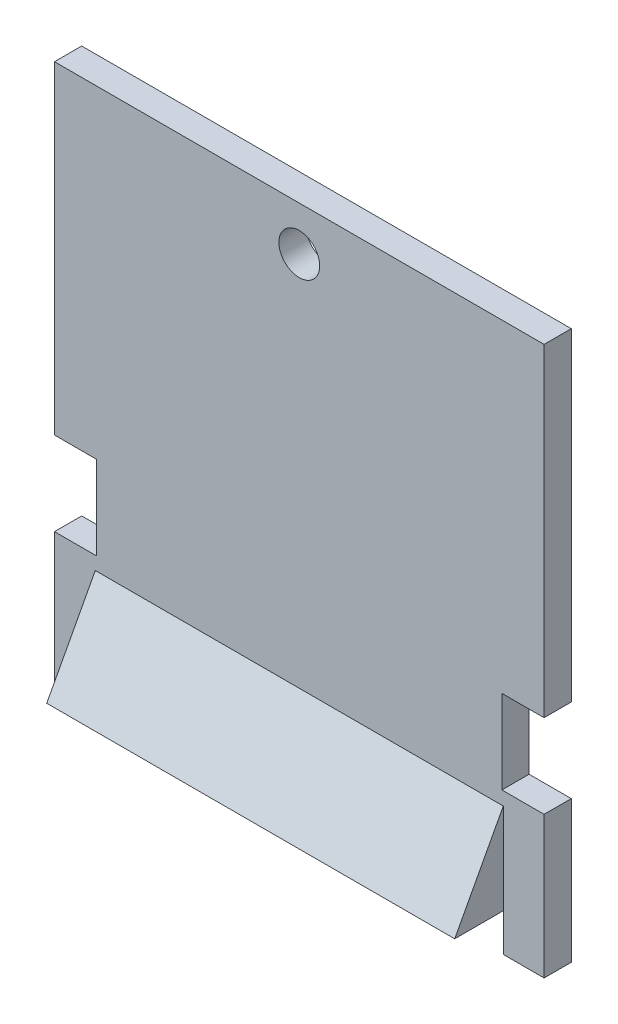
ISO-10303-21;
HEADER;
FILE_DESCRIPTION(('STEP AP214'),'2;1');
FILE_NAME('part.step','',(''),(''),'','','');
FILE_SCHEMA(('AUTOMOTIVE_DESIGN { 1 0 10303 214 1 1 1 1 }'));
ENDSEC;
DATA;
#1=APPLICATION_CONTEXT('core data for automotive mechanical design processes');
#2=APPLICATION_PROTOCOL_DEFINITION('international standard','automotive_design',2000,#1);
#3=PRODUCT_CONTEXT('',#1,'mechanical');
#4=PRODUCT('Part','Part','',(#3));
#5=PRODUCT_RELATED_PRODUCT_CATEGORY('part','',(#4));
#6=PRODUCT_DEFINITION_FORMATION('','',#4);
#7=PRODUCT_DEFINITION_CONTEXT('part definition',#1,'design');
#8=PRODUCT_DEFINITION('design','',#6,#7);
#9=PRODUCT_DEFINITION_SHAPE('','',#8);
#10=(LENGTH_UNIT() NAMED_UNIT(*) SI_UNIT(.MILLI.,.METRE.));
#11=(NAMED_UNIT(*) PLANE_ANGLE_UNIT() SI_UNIT($,.RADIAN.));
#12=(NAMED_UNIT(*) SI_UNIT($,.STERADIAN.) SOLID_ANGLE_UNIT());
#13=UNCERTAINTY_MEASURE_WITH_UNIT(LENGTH_MEASURE(1.E-05),#10,'distance_accuracy_value','');
#14=(GEOMETRIC_REPRESENTATION_CONTEXT(3) GLOBAL_UNCERTAINTY_ASSIGNED_CONTEXT((#13)) GLOBAL_UNIT_ASSIGNED_CONTEXT((#10,
#11,#12)) REPRESENTATION_CONTEXT('',''));
#15=CARTESIAN_POINT('',(0.,0.,0.));
#16=DIRECTION('',(0.,0.,1.));
#17=DIRECTION('',(1.,0.,0.));
#18=AXIS2_PLACEMENT_3D('',#15,#16,#17);
#19=CARTESIAN_POINT('',(-18.,0.,0.));
#20=DIRECTION('',(1.,0.,0.));
#21=DIRECTION('',(0.,0.,-1.));
#22=AXIS2_PLACEMENT_3D('',#19,#20,#21);
#23=PLANE('',#22);
#24=DIRECTION('',(0.,-1.,0.));
#25=VECTOR('',#24,1.);
#26=CARTESIAN_POINT('',(-18.,2.78,2.));
#27=LINE('',#26,#25);
#28=CARTESIAN_POINT('',(-18.,10.425,2.));
#29=VERTEX_POINT('',#28);
#30=CARTESIAN_POINT('',(-18.,0.,2.));
#31=VERTEX_POINT('',#30);
#32=EDGE_CURVE('E279',#29,#31,#27,.T.);
#33=ORIENTED_EDGE('',*,*,#32,.F.);
#34=DIRECTION('',(0.,0.,-1.));
#35=VECTOR('',#34,1.);
#36=CARTESIAN_POINT('',(-18.,10.425,0.));
#37=LINE('',#36,#35);
#38=CARTESIAN_POINT('',(-18.,10.425,0.));
#39=VERTEX_POINT('',#38);
#40=EDGE_CURVE('E216',#29,#39,#37,.T.);
#41=ORIENTED_EDGE('',*,*,#40,.T.);
#42=DIRECTION('',(0.,1.,0.));
#43=VECTOR('',#42,1.);
#44=CARTESIAN_POINT('',(-18.,0.,0.));
#45=LINE('',#44,#43);
#46=CARTESIAN_POINT('',(-18.,0.,0.));
#47=VERTEX_POINT('',#46);
#48=EDGE_CURVE('E292',#47,#39,#45,.T.);
#49=ORIENTED_EDGE('',*,*,#48,.F.);
#50=DIRECTION('',(0.,0.,-1.));
#51=VECTOR('',#50,1.);
#52=CARTESIAN_POINT('',(-18.,0.,2.));
#53=LINE('',#52,#51);
#54=EDGE_CURVE('E213',#31,#47,#53,.T.);
#55=ORIENTED_EDGE('',*,*,#54,.F.);
#56=EDGE_LOOP('',(#33,#41,#49,#55));
#57=FACE_BOUND('',#56,.T.);
#58=ADVANCED_FACE('F34',(#57),#23,.F.);
#59=CARTESIAN_POINT('',(18.,9.45,2.));
#60=DIRECTION('',(0.,-0.471891250848428,-0.881656762789639));
#61=DIRECTION('',(0.,0.881656762789639,-0.471891250848428));
#62=AXIS2_PLACEMENT_3D('',#59,#60,#61);
#63=PLANE('',#62);
#64=DIRECTION('',(0.,0.881656762789639,-0.471891250848428));
#65=VECTOR('',#64,1.);
#66=CARTESIAN_POINT('',(-15.,9.45000000000002,1.99999999999999));
#67=LINE('',#66,#65);
#68=CARTESIAN_POINT('',(-15.,2.78,5.57));
#69=VERTEX_POINT('',#68);
#70=CARTESIAN_POINT('',(-15.,9.45,1.99999999999999));
#71=VERTEX_POINT('',#70);
#72=EDGE_CURVE('E162',#69,#71,#67,.T.);
#73=ORIENTED_EDGE('',*,*,#72,.F.);
#74=DIRECTION('',(-1.,0.,0.));
#75=VECTOR('',#74,1.);
#76=CARTESIAN_POINT('',(18.,2.78,5.57));
#77=LINE('',#76,#75);
#78=CARTESIAN_POINT('',(15.,2.78,5.57));
#79=VERTEX_POINT('',#78);
#80=EDGE_CURVE('E175',#79,#69,#77,.T.);
#81=ORIENTED_EDGE('',*,*,#80,.F.);
#82=DIRECTION('',(0.,-0.881656762789639,0.471891250848428));
#83=VECTOR('',#82,1.);
#84=CARTESIAN_POINT('',(15.,9.45,2.));
#85=LINE('',#84,#83);
#86=CARTESIAN_POINT('',(15.,9.45,1.99999999999999));
#87=VERTEX_POINT('',#86);
#88=EDGE_CURVE('E168',#87,#79,#85,.T.);
#89=ORIENTED_EDGE('',*,*,#88,.F.);
#90=DIRECTION('',(-1.,0.,0.));
#91=VECTOR('',#90,1.);
#92=CARTESIAN_POINT('',(18.,9.45,2.));
#93=LINE('',#92,#91);
#94=EDGE_CURVE('E177',#87,#71,#93,.T.);
#95=ORIENTED_EDGE('',*,*,#94,.T.);
#96=EDGE_LOOP('',(#73,#81,#89,#95));
#97=FACE_BOUND('',#96,.T.);
#98=ADVANCED_FACE('F173',(#97),#63,.F.);
#99=CARTESIAN_POINT('',(18.,2.78,5.57));
#100=DIRECTION('',(0.,1.,0.));
#101=DIRECTION('',(0.,0.,1.));
#102=AXIS2_PLACEMENT_3D('',#99,#100,#101);
#103=PLANE('',#102);
#104=DIRECTION('',(0.,0.,-1.));
#105=VECTOR('',#104,1.);
#106=CARTESIAN_POINT('',(-15.,2.78,5.57));
#107=LINE('',#106,#105);
#108=CARTESIAN_POINT('',(-15.,2.78,1.99999999999999));
#109=VERTEX_POINT('',#108);
#110=EDGE_CURVE('E159',#69,#109,#107,.T.);
#111=ORIENTED_EDGE('',*,*,#110,.T.);
#112=DIRECTION('',(0.,0.,-1.));
#113=VECTOR('',#112,1.);
#114=CARTESIAN_POINT('',(-15.,2.78,5.57));
#115=LINE('',#114,#113);
#116=CARTESIAN_POINT('',(-15.,2.78,0.));
#117=VERTEX_POINT('',#116);
#118=EDGE_CURVE('E267',#109,#117,#115,.T.);
#119=ORIENTED_EDGE('',*,*,#118,.T.);
#120=DIRECTION('',(1.,0.,0.));
#121=VECTOR('',#120,1.);
#122=CARTESIAN_POINT('',(15.,2.78,0.));
#123=LINE('',#122,#121);
#124=CARTESIAN_POINT('',(15.,2.78,0.));
#125=VERTEX_POINT('',#124);
#126=EDGE_CURVE('E262',#117,#125,#123,.T.);
#127=ORIENTED_EDGE('',*,*,#126,.T.);
#128=DIRECTION('',(0.,0.,-1.));
#129=VECTOR('',#128,1.);
#130=CARTESIAN_POINT('',(15.,2.78,5.57));
#131=LINE('',#130,#129);
#132=CARTESIAN_POINT('',(15.,2.78,1.99999999999999));
#133=VERTEX_POINT('',#132);
#134=EDGE_CURVE('E214',#133,#125,#131,.T.);
#135=ORIENTED_EDGE('',*,*,#134,.F.);
#136=DIRECTION('',(0.,0.,-1.));
#137=VECTOR('',#136,1.);
#138=CARTESIAN_POINT('',(15.,2.78,5.57));
#139=LINE('',#138,#137);
#140=EDGE_CURVE('E184',#79,#133,#139,.T.);
#141=ORIENTED_EDGE('',*,*,#140,.F.);
#142=ORIENTED_EDGE('',*,*,#80,.T.);
#143=EDGE_LOOP('',(#111,#119,#127,#135,#141,#142));
#144=FACE_BOUND('',#143,.T.);
#145=ADVANCED_FACE('F181',(#144),#103,.F.);
#146=CARTESIAN_POINT('',(18.,0.,0.));
#147=DIRECTION('',(1.,0.,0.));
#148=DIRECTION('',(0.,0.,-1.));
#149=AXIS2_PLACEMENT_3D('',#146,#147,#148);
#150=PLANE('',#149);
#151=DIRECTION('',(0.,0.,1.));
#152=VECTOR('',#151,1.);
#153=CARTESIAN_POINT('',(18.,16.575,0.));
#154=LINE('',#153,#152);
#155=CARTESIAN_POINT('',(18.,16.575,0.));
#156=VERTEX_POINT('',#155);
#157=CARTESIAN_POINT('',(18.,16.575,2.));
#158=VERTEX_POINT('',#157);
#159=EDGE_CURVE('E221',#156,#158,#154,.T.);
#160=ORIENTED_EDGE('',*,*,#159,.F.);
#161=DIRECTION('',(0.,1.,0.));
#162=VECTOR('',#161,1.);
#163=CARTESIAN_POINT('',(18.,0.,0.));
#164=LINE('',#163,#162);
#165=CARTESIAN_POINT('',(18.,40.35,0.));
#166=VERTEX_POINT('',#165);
#167=EDGE_CURVE('E278',#156,#166,#164,.T.);
#168=ORIENTED_EDGE('',*,*,#167,.T.);
#169=DIRECTION('',(0.,0.,1.));
#170=VECTOR('',#169,1.);
#171=CARTESIAN_POINT('',(18.,40.35,0.));
#172=LINE('',#171,#170);
#173=CARTESIAN_POINT('',(18.,40.35,2.));
#174=VERTEX_POINT('',#173);
#175=EDGE_CURVE('E283',#166,#174,#172,.T.);
#176=ORIENTED_EDGE('',*,*,#175,.T.);
#177=DIRECTION('',(0.,-1.,0.));
#178=VECTOR('',#177,1.);
#179=CARTESIAN_POINT('',(18.,40.35,2.));
#180=LINE('',#179,#178);
#181=EDGE_CURVE('E285',#174,#158,#180,.T.);
#182=ORIENTED_EDGE('',*,*,#181,.T.);
#183=EDGE_LOOP('',(#160,#168,#176,#182));
#184=FACE_BOUND('',#183,.T.);
#185=ADVANCED_FACE('F363',(#184),#150,.T.);
#186=CARTESIAN_POINT('',(18.,0.,2.));
#187=DIRECTION('',(0.,1.,0.));
#188=DIRECTION('',(0.,0.,1.));
#189=AXIS2_PLACEMENT_3D('',#186,#187,#188);
#190=PLANE('',#189);
#191=DIRECTION('',(-1.,0.,0.));
#192=VECTOR('',#191,1.);
#193=CARTESIAN_POINT('',(18.,0.,2.));
#194=LINE('',#193,#192);
#195=CARTESIAN_POINT('',(18.,0.,2.));
#196=VERTEX_POINT('',#195);
#197=CARTESIAN_POINT('',(15.,0.,2.));
#198=VERTEX_POINT('',#197);
#199=EDGE_CURVE('E185',#196,#198,#194,.T.);
#200=ORIENTED_EDGE('',*,*,#199,.T.);
#201=DIRECTION('',(0.,0.,-1.));
#202=VECTOR('',#201,1.);
#203=CARTESIAN_POINT('',(15.,0.,5.57));
#204=LINE('',#203,#202);
#205=CARTESIAN_POINT('',(15.,0.,0.));
#206=VERTEX_POINT('',#205);
#207=EDGE_CURVE('E265',#198,#206,#204,.T.);
#208=ORIENTED_EDGE('',*,*,#207,.T.);
#209=DIRECTION('',(-1.,0.,0.));
#210=VECTOR('',#209,1.);
#211=CARTESIAN_POINT('',(18.,0.,0.));
#212=LINE('',#211,#210);
#213=CARTESIAN_POINT('',(18.,0.,0.));
#214=VERTEX_POINT('',#213);
#215=EDGE_CURVE('E200',#214,#206,#212,.T.);
#216=ORIENTED_EDGE('',*,*,#215,.F.);
#217=DIRECTION('',(0.,0.,-1.));
#218=VECTOR('',#217,1.);
#219=CARTESIAN_POINT('',(18.,0.,2.));
#220=LINE('',#219,#218);
#221=EDGE_CURVE('E275',#196,#214,#220,.T.);
#222=ORIENTED_EDGE('',*,*,#221,.F.);
#223=EDGE_LOOP('',(#200,#208,#216,#222));
#224=FACE_BOUND('',#223,.T.);
#225=ADVANCED_FACE('F390',(#224),#190,.F.);
#226=CARTESIAN_POINT('',(-15.,0.,0.));
#227=VERTEX_POINT('',#226);
#228=EDGE_CURVE('E199',#227,#47,#212,.T.);
#229=ORIENTED_EDGE('',*,*,#228,.F.);
#230=DIRECTION('',(0.,0.,-1.));
#231=VECTOR('',#230,1.);
#232=CARTESIAN_POINT('',(-15.,0.,5.57));
#233=LINE('',#232,#231);
#234=CARTESIAN_POINT('',(-15.,0.,2.));
#235=VERTEX_POINT('',#234);
#236=EDGE_CURVE('E269',#235,#227,#233,.T.);
#237=ORIENTED_EDGE('',*,*,#236,.F.);
#238=EDGE_CURVE('E190',#235,#31,#194,.T.);
#239=ORIENTED_EDGE('',*,*,#238,.T.);
#240=ORIENTED_EDGE('',*,*,#54,.T.);
#241=EDGE_LOOP('',(#229,#237,#239,#240));
#242=FACE_BOUND('',#241,.T.);
#243=ADVANCED_FACE('F36',(#242),#190,.F.);
#244=CARTESIAN_POINT('',(18.,0.,0.));
#245=DIRECTION('',(0.,0.,1.));
#246=DIRECTION('',(0.,-1.,0.));
#247=AXIS2_PLACEMENT_3D('',#244,#245,#246);
#248=PLANE('',#247);
#249=CARTESIAN_POINT('',(0.,37.1,0.));
#250=DIRECTION('',(0.,0.,-1.));
#251=DIRECTION('',(-1.,0.,0.));
#252=AXIS2_PLACEMENT_3D('',#249,#250,#251);
#253=CIRCLE('',#252,1.5);
#254=CARTESIAN_POINT('',(-1.5,37.1,0.));
#255=VERTEX_POINT('',#254);
#256=EDGE_CURVE('E256',#255,#255,#253,.T.);
#257=ORIENTED_EDGE('',*,*,#256,.F.);
#258=EDGE_LOOP('',(#257));
#259=FACE_BOUND('',#258,.T.);
#260=ORIENTED_EDGE('',*,*,#167,.F.);
#261=DIRECTION('',(1.,0.,0.));
#262=VECTOR('',#261,1.);
#263=CARTESIAN_POINT('',(18.,16.575,0.));
#264=LINE('',#263,#262);
#265=CARTESIAN_POINT('',(14.9,16.575,0.));
#266=VERTEX_POINT('',#265);
#267=EDGE_CURVE('E323',#266,#156,#264,.T.);
#268=ORIENTED_EDGE('',*,*,#267,.F.);
#269=DIRECTION('',(0.,1.,0.));
#270=VECTOR('',#269,1.);
#271=CARTESIAN_POINT('',(14.9,16.575,0.));
#272=LINE('',#271,#270);
#273=CARTESIAN_POINT('',(14.9,10.425,0.));
#274=VERTEX_POINT('',#273);
#275=EDGE_CURVE('E320',#274,#266,#272,.T.);
#276=ORIENTED_EDGE('',*,*,#275,.F.);
#277=DIRECTION('',(-1.,0.,0.));
#278=VECTOR('',#277,1.);
#279=CARTESIAN_POINT('',(18.,10.425,0.));
#280=LINE('',#279,#278);
#281=CARTESIAN_POINT('',(18.,10.425,0.));
#282=VERTEX_POINT('',#281);
#283=EDGE_CURVE('E243',#282,#274,#280,.T.);
#284=ORIENTED_EDGE('',*,*,#283,.F.);
#285=EDGE_CURVE('E280',#214,#282,#164,.T.);
#286=ORIENTED_EDGE('',*,*,#285,.F.);
#287=ORIENTED_EDGE('',*,*,#215,.T.);
#288=DIRECTION('',(0.,-1.,0.));
#289=VECTOR('',#288,1.);
#290=CARTESIAN_POINT('',(15.,0.,0.));
#291=LINE('',#290,#289);
#292=EDGE_CURVE('E257',#125,#206,#291,.T.);
#293=ORIENTED_EDGE('',*,*,#292,.F.);
#294=ORIENTED_EDGE('',*,*,#126,.F.);
#295=DIRECTION('',(0.,1.,0.));
#296=VECTOR('',#295,1.);
#297=CARTESIAN_POINT('',(-15.,0.,0.));
#298=LINE('',#297,#296);
#299=EDGE_CURVE('E259',#227,#117,#298,.T.);
#300=ORIENTED_EDGE('',*,*,#299,.F.);
#301=ORIENTED_EDGE('',*,*,#228,.T.);
#302=ORIENTED_EDGE('',*,*,#48,.T.);
#303=DIRECTION('',(-1.,0.,0.));
#304=VECTOR('',#303,1.);
#305=CARTESIAN_POINT('',(-18.,10.425,0.));
#306=LINE('',#305,#304);
#307=CARTESIAN_POINT('',(-14.9,10.425,0.));
#308=VERTEX_POINT('',#307);
#309=EDGE_CURVE('E241',#308,#39,#306,.T.);
#310=ORIENTED_EDGE('',*,*,#309,.F.);
#311=DIRECTION('',(0.,-1.,0.));
#312=VECTOR('',#311,1.);
#313=CARTESIAN_POINT('',(-14.9,16.575,0.));
#314=LINE('',#313,#312);
#315=CARTESIAN_POINT('',(-14.9,16.575,0.));
#316=VERTEX_POINT('',#315);
#317=EDGE_CURVE('E245',#316,#308,#314,.T.);
#318=ORIENTED_EDGE('',*,*,#317,.F.);
#319=DIRECTION('',(1.,0.,0.));
#320=VECTOR('',#319,1.);
#321=CARTESIAN_POINT('',(-18.,16.575,0.));
#322=LINE('',#321,#320);
#323=CARTESIAN_POINT('',(-18.,16.575,0.));
#324=VERTEX_POINT('',#323);
#325=EDGE_CURVE('E178',#324,#316,#322,.T.);
#326=ORIENTED_EDGE('',*,*,#325,.F.);
#327=CARTESIAN_POINT('',(-18.,40.35,0.));
#328=VERTEX_POINT('',#327);
#329=EDGE_CURVE('E291',#324,#328,#45,.T.);
#330=ORIENTED_EDGE('',*,*,#329,.T.);
#331=DIRECTION('',(-1.,0.,0.));
#332=VECTOR('',#331,1.);
#333=CARTESIAN_POINT('',(18.,40.35,0.));
#334=LINE('',#333,#332);
#335=EDGE_CURVE('E196',#166,#328,#334,.T.);
#336=ORIENTED_EDGE('',*,*,#335,.F.);
#337=EDGE_LOOP('',(#260,#268,#276,#284,#286,#287,#293,#294,#300,#301,#302,#310,#318,#326,#330,#336));
#338=FACE_BOUND('',#337,.T.);
#339=ADVANCED_FACE('F310',(#259,#338),#248,.F.);
#340=CARTESIAN_POINT('',(18.,40.35,0.));
#341=DIRECTION('',(0.,-1.,0.));
#342=DIRECTION('',(0.,0.,-1.));
#343=AXIS2_PLACEMENT_3D('',#340,#341,#342);
#344=PLANE('',#343);
#345=DIRECTION('',(0.,0.,1.));
#346=VECTOR('',#345,1.);
#347=CARTESIAN_POINT('',(-18.,40.35,0.));
#348=LINE('',#347,#346);
#349=CARTESIAN_POINT('',(-18.,40.35,2.));
#350=VERTEX_POINT('',#349);
#351=EDGE_CURVE('E295',#328,#350,#348,.T.);
#352=ORIENTED_EDGE('',*,*,#351,.T.);
#353=DIRECTION('',(-1.,0.,0.));
#354=VECTOR('',#353,1.);
#355=CARTESIAN_POINT('',(18.,40.35,2.));
#356=LINE('',#355,#354);
#357=EDGE_CURVE('E187',#174,#350,#356,.T.);
#358=ORIENTED_EDGE('',*,*,#357,.F.);
#359=ORIENTED_EDGE('',*,*,#175,.F.);
#360=ORIENTED_EDGE('',*,*,#335,.T.);
#361=EDGE_LOOP('',(#352,#358,#359,#360));
#362=FACE_BOUND('',#361,.T.);
#363=ADVANCED_FACE('F370',(#362),#344,.F.);
#364=CARTESIAN_POINT('',(18.,2.78,2.));
#365=DIRECTION('',(0.,0.,-1.));
#366=DIRECTION('',(-1.,0.,0.));
#367=AXIS2_PLACEMENT_3D('',#364,#365,#366);
#368=PLANE('',#367);
#369=ORIENTED_EDGE('',*,*,#238,.F.);
#370=DIRECTION('',(0.,1.,0.));
#371=VECTOR('',#370,1.);
#372=CARTESIAN_POINT('',(-15.,2.78,2.));
#373=LINE('',#372,#371);
#374=EDGE_CURVE('E203',#235,#109,#373,.T.);
#375=ORIENTED_EDGE('',*,*,#374,.T.);
#376=DIRECTION('',(0.,1.,0.));
#377=VECTOR('',#376,1.);
#378=CARTESIAN_POINT('',(-15.,10.425,1.99999999999999));
#379=LINE('',#378,#377);
#380=EDGE_CURVE('E164',#109,#71,#379,.T.);
#381=ORIENTED_EDGE('',*,*,#380,.T.);
#382=ORIENTED_EDGE('',*,*,#94,.F.);
#383=DIRECTION('',(0.,-1.,0.));
#384=VECTOR('',#383,1.);
#385=CARTESIAN_POINT('',(15.,10.425,1.99999999999999));
#386=LINE('',#385,#384);
#387=EDGE_CURVE('E313',#87,#133,#386,.T.);
#388=ORIENTED_EDGE('',*,*,#387,.T.);
#389=DIRECTION('',(0.,-1.,0.));
#390=VECTOR('',#389,1.);
#391=CARTESIAN_POINT('',(15.,2.78,2.));
#392=LINE('',#391,#390);
#393=EDGE_CURVE('E206',#133,#198,#392,.T.);
#394=ORIENTED_EDGE('',*,*,#393,.T.);
#395=ORIENTED_EDGE('',*,*,#199,.F.);
#396=DIRECTION('',(0.,-1.,0.));
#397=VECTOR('',#396,1.);
#398=CARTESIAN_POINT('',(18.,2.78,2.));
#399=LINE('',#398,#397);
#400=CARTESIAN_POINT('',(18.,10.425,2.));
#401=VERTEX_POINT('',#400);
#402=EDGE_CURVE('E49',#401,#196,#399,.T.);
#403=ORIENTED_EDGE('',*,*,#402,.F.);
#404=DIRECTION('',(-1.,0.,0.));
#405=VECTOR('',#404,1.);
#406=CARTESIAN_POINT('',(18.,10.425,2.));
#407=LINE('',#406,#405);
#408=CARTESIAN_POINT('',(14.9,10.425,2.));
#409=VERTEX_POINT('',#408);
#410=EDGE_CURVE('E251',#401,#409,#407,.T.);
#411=ORIENTED_EDGE('',*,*,#410,.T.);
#412=DIRECTION('',(0.,1.,0.));
#413=VECTOR('',#412,1.);
#414=CARTESIAN_POINT('',(14.9,40.35,2.));
#415=LINE('',#414,#413);
#416=CARTESIAN_POINT('',(14.9,16.575,2.));
#417=VERTEX_POINT('',#416);
#418=EDGE_CURVE('E11',#409,#417,#415,.T.);
#419=ORIENTED_EDGE('',*,*,#418,.T.);
#420=DIRECTION('',(1.,0.,0.));
#421=VECTOR('',#420,1.);
#422=CARTESIAN_POINT('',(18.,16.575,2.));
#423=LINE('',#422,#421);
#424=EDGE_CURVE('E253',#417,#158,#423,.T.);
#425=ORIENTED_EDGE('',*,*,#424,.T.);
#426=ORIENTED_EDGE('',*,*,#181,.F.);
#427=ORIENTED_EDGE('',*,*,#357,.T.);
#428=DIRECTION('',(0.,-1.,0.));
#429=VECTOR('',#428,1.);
#430=CARTESIAN_POINT('',(-18.,40.35,2.));
#431=LINE('',#430,#429);
#432=CARTESIAN_POINT('',(-18.,16.575,2.));
#433=VERTEX_POINT('',#432);
#434=EDGE_CURVE('E297',#350,#433,#431,.T.);
#435=ORIENTED_EDGE('',*,*,#434,.T.);
#436=DIRECTION('',(1.,0.,0.));
#437=VECTOR('',#436,1.);
#438=CARTESIAN_POINT('',(18.,16.5750000000001,2.));
#439=LINE('',#438,#437);
#440=CARTESIAN_POINT('',(-14.9,16.575,2.));
#441=VERTEX_POINT('',#440);
#442=EDGE_CURVE('E57',#433,#441,#439,.T.);
#443=ORIENTED_EDGE('',*,*,#442,.T.);
#444=DIRECTION('',(0.,-1.,0.));
#445=VECTOR('',#444,1.);
#446=CARTESIAN_POINT('',(-14.9,40.35,2.));
#447=LINE('',#446,#445);
#448=CARTESIAN_POINT('',(-14.9,10.425,2.));
#449=VERTEX_POINT('',#448);
#450=EDGE_CURVE('E42',#441,#449,#447,.T.);
#451=ORIENTED_EDGE('',*,*,#450,.T.);
#452=DIRECTION('',(-1.,0.,0.));
#453=VECTOR('',#452,1.);
#454=CARTESIAN_POINT('',(18.,10.4250000000001,2.));
#455=LINE('',#454,#453);
#456=EDGE_CURVE('E228',#449,#29,#455,.T.);
#457=ORIENTED_EDGE('',*,*,#456,.T.);
#458=ORIENTED_EDGE('',*,*,#32,.T.);
#459=EDGE_LOOP('',(#369,#375,#381,#382,#388,#394,#395,#403,#411,#419,#425,#426,#427,#435,#443,
#451,#457,#458));
#460=FACE_BOUND('',#459,.T.);
#461=CARTESIAN_POINT('',(0.,37.1,2.));
#462=DIRECTION('',(0.,0.,-1.));
#463=DIRECTION('',(0.,1.,0.));
#464=AXIS2_PLACEMENT_3D('',#461,#462,#463);
#465=CIRCLE('',#464,1.5);
#466=CARTESIAN_POINT('',(0.,38.6,2.));
#467=VERTEX_POINT('',#466);
#468=EDGE_CURVE('E210',#467,#467,#465,.T.);
#469=ORIENTED_EDGE('',*,*,#468,.T.);
#470=EDGE_LOOP('',(#469));
#471=FACE_BOUND('',#470,.T.);
#472=ADVANCED_FACE('F225',(#460,#471),#368,.F.);
#473=DIRECTION('',(0.,0.,-1.));
#474=VECTOR('',#473,1.);
#475=CARTESIAN_POINT('',(18.,10.425,0.));
#476=LINE('',#475,#474);
#477=EDGE_CURVE('E219',#401,#282,#476,.T.);
#478=ORIENTED_EDGE('',*,*,#477,.F.);
#479=ORIENTED_EDGE('',*,*,#402,.T.);
#480=ORIENTED_EDGE('',*,*,#221,.T.);
#481=ORIENTED_EDGE('',*,*,#285,.T.);
#482=EDGE_LOOP('',(#478,#479,#480,#481));
#483=FACE_BOUND('',#482,.T.);
#484=ADVANCED_FACE('F354',(#483),#150,.T.);
#485=ORIENTED_EDGE('',*,*,#329,.F.);
#486=DIRECTION('',(0.,0.,1.));
#487=VECTOR('',#486,1.);
#488=CARTESIAN_POINT('',(-18.,16.575,0.));
#489=LINE('',#488,#487);
#490=EDGE_CURVE('E209',#324,#433,#489,.T.);
#491=ORIENTED_EDGE('',*,*,#490,.T.);
#492=ORIENTED_EDGE('',*,*,#434,.F.);
#493=ORIENTED_EDGE('',*,*,#351,.F.);
#494=EDGE_LOOP('',(#485,#491,#492,#493));
#495=FACE_BOUND('',#494,.T.);
#496=ADVANCED_FACE('F345',(#495),#23,.F.);
#497=CARTESIAN_POINT('',(15.,0.,5.57));
#498=DIRECTION('',(1.,0.,0.));
#499=DIRECTION('',(0.,0.,-1.));
#500=AXIS2_PLACEMENT_3D('',#497,#498,#499);
#501=PLANE('',#500);
#502=ORIENTED_EDGE('',*,*,#134,.T.);
#503=ORIENTED_EDGE('',*,*,#292,.T.);
#504=ORIENTED_EDGE('',*,*,#207,.F.);
#505=ORIENTED_EDGE('',*,*,#393,.F.);
#506=EDGE_LOOP('',(#502,#503,#504,#505));
#507=FACE_BOUND('',#506,.T.);
#508=ADVANCED_FACE('F353',(#507),#501,.F.);
#509=CARTESIAN_POINT('',(-15.,0.,5.57));
#510=DIRECTION('',(-1.,0.,0.));
#511=DIRECTION('',(0.,0.,1.));
#512=AXIS2_PLACEMENT_3D('',#509,#510,#511);
#513=PLANE('',#512);
#514=ORIENTED_EDGE('',*,*,#236,.T.);
#515=ORIENTED_EDGE('',*,*,#299,.T.);
#516=ORIENTED_EDGE('',*,*,#118,.F.);
#517=ORIENTED_EDGE('',*,*,#374,.F.);
#518=EDGE_LOOP('',(#514,#515,#516,#517));
#519=FACE_BOUND('',#518,.T.);
#520=ADVANCED_FACE('F306',(#519),#513,.F.);
#521=CARTESIAN_POINT('',(0.,37.1,5.57));
#522=DIRECTION('',(0.,0.,-1.));
#523=DIRECTION('',(-1.,0.,0.));
#524=AXIS2_PLACEMENT_3D('',#521,#522,#523);
#525=CYLINDRICAL_SURFACE('',#524,1.5);
#526=ORIENTED_EDGE('',*,*,#256,.T.);
#527=EDGE_LOOP('',(#526));
#528=FACE_BOUND('',#527,.T.);
#529=ORIENTED_EDGE('',*,*,#468,.F.);
#530=EDGE_LOOP('',(#529));
#531=FACE_BOUND('',#530,.T.);
#532=ADVANCED_FACE('F340',(#528,#531),#525,.F.);
#533=CARTESIAN_POINT('',(-14.9,16.575,5.57));
#534=DIRECTION('',(1.,0.,0.));
#535=DIRECTION('',(0.,1.,0.));
#536=AXIS2_PLACEMENT_3D('',#533,#534,#535);
#537=PLANE('',#536);
#538=DIRECTION('',(0.,0.,-1.));
#539=VECTOR('',#538,1.);
#540=CARTESIAN_POINT('',(-14.9,16.575,5.57));
#541=LINE('',#540,#539);
#542=EDGE_CURVE('E235',#441,#316,#541,.T.);
#543=ORIENTED_EDGE('',*,*,#542,.T.);
#544=ORIENTED_EDGE('',*,*,#317,.T.);
#545=DIRECTION('',(0.,0.,-1.));
#546=VECTOR('',#545,1.);
#547=CARTESIAN_POINT('',(-14.9,10.425,5.57));
#548=LINE('',#547,#546);
#549=EDGE_CURVE('E237',#449,#308,#548,.T.);
#550=ORIENTED_EDGE('',*,*,#549,.F.);
#551=ORIENTED_EDGE('',*,*,#450,.F.);
#552=EDGE_LOOP('',(#543,#544,#550,#551));
#553=FACE_BOUND('',#552,.T.);
#554=ADVANCED_FACE('F233',(#553),#537,.F.);
#555=CARTESIAN_POINT('',(-18.,10.425,5.57));
#556=DIRECTION('',(0.,-1.,0.));
#557=DIRECTION('',(1.,0.,0.));
#558=AXIS2_PLACEMENT_3D('',#555,#556,#557);
#559=PLANE('',#558);
#560=ORIENTED_EDGE('',*,*,#549,.T.);
#561=ORIENTED_EDGE('',*,*,#309,.T.);
#562=ORIENTED_EDGE('',*,*,#40,.F.);
#563=ORIENTED_EDGE('',*,*,#456,.F.);
#564=EDGE_LOOP('',(#560,#561,#562,#563));
#565=FACE_BOUND('',#564,.T.);
#566=ADVANCED_FACE('F331',(#565),#559,.F.);
#567=CARTESIAN_POINT('',(-18.,16.575,5.57));
#568=DIRECTION('',(0.,1.,0.));
#569=DIRECTION('',(-1.,0.,0.));
#570=AXIS2_PLACEMENT_3D('',#567,#568,#569);
#571=PLANE('',#570);
#572=ORIENTED_EDGE('',*,*,#490,.F.);
#573=ORIENTED_EDGE('',*,*,#325,.T.);
#574=ORIENTED_EDGE('',*,*,#542,.F.);
#575=ORIENTED_EDGE('',*,*,#442,.F.);
#576=EDGE_LOOP('',(#572,#573,#574,#575));
#577=FACE_BOUND('',#576,.T.);
#578=ADVANCED_FACE('F238',(#577),#571,.F.);
#579=CARTESIAN_POINT('',(14.9,16.575,5.57));
#580=DIRECTION('',(-1.,0.,0.));
#581=DIRECTION('',(0.,-1.,0.));
#582=AXIS2_PLACEMENT_3D('',#579,#580,#581);
#583=PLANE('',#582);
#584=DIRECTION('',(0.,0.,-1.));
#585=VECTOR('',#584,1.);
#586=CARTESIAN_POINT('',(14.9,10.425,5.57));
#587=LINE('',#586,#585);
#588=EDGE_CURVE('E325',#409,#274,#587,.T.);
#589=ORIENTED_EDGE('',*,*,#588,.T.);
#590=ORIENTED_EDGE('',*,*,#275,.T.);
#591=DIRECTION('',(0.,0.,-1.));
#592=VECTOR('',#591,1.);
#593=CARTESIAN_POINT('',(14.9,16.575,5.57));
#594=LINE('',#593,#592);
#595=EDGE_CURVE('E249',#417,#266,#594,.T.);
#596=ORIENTED_EDGE('',*,*,#595,.F.);
#597=ORIENTED_EDGE('',*,*,#418,.F.);
#598=EDGE_LOOP('',(#589,#590,#596,#597));
#599=FACE_BOUND('',#598,.T.);
#600=ADVANCED_FACE('F338',(#599),#583,.F.);
#601=CARTESIAN_POINT('',(18.,16.575,5.57));
#602=DIRECTION('',(0.,1.,0.));
#603=DIRECTION('',(-1.,0.,0.));
#604=AXIS2_PLACEMENT_3D('',#601,#602,#603);
#605=PLANE('',#604);
#606=ORIENTED_EDGE('',*,*,#595,.T.);
#607=ORIENTED_EDGE('',*,*,#267,.T.);
#608=ORIENTED_EDGE('',*,*,#159,.T.);
#609=ORIENTED_EDGE('',*,*,#424,.F.);
#610=EDGE_LOOP('',(#606,#607,#608,#609));
#611=FACE_BOUND('',#610,.T.);
#612=ADVANCED_FACE('F379',(#611),#605,.F.);
#613=CARTESIAN_POINT('',(18.,10.425,5.57));
#614=DIRECTION('',(0.,-1.,0.));
#615=DIRECTION('',(0.,0.,-1.));
#616=AXIS2_PLACEMENT_3D('',#613,#614,#615);
#617=PLANE('',#616);
#618=ORIENTED_EDGE('',*,*,#477,.T.);
#619=ORIENTED_EDGE('',*,*,#283,.T.);
#620=ORIENTED_EDGE('',*,*,#588,.F.);
#621=ORIENTED_EDGE('',*,*,#410,.F.);
#622=EDGE_LOOP('',(#618,#619,#620,#621));
#623=FACE_BOUND('',#622,.T.);
#624=ADVANCED_FACE('F385',(#623),#617,.F.);
#625=CARTESIAN_POINT('',(15.,10.425,5.57));
#626=DIRECTION('',(1.,0.,0.));
#627=DIRECTION('',(0.,0.,-1.));
#628=AXIS2_PLACEMENT_3D('',#625,#626,#627);
#629=PLANE('',#628);
#630=ORIENTED_EDGE('',*,*,#88,.T.);
#631=ORIENTED_EDGE('',*,*,#140,.T.);
#632=ORIENTED_EDGE('',*,*,#387,.F.);
#633=EDGE_LOOP('',(#630,#631,#632));
#634=FACE_BOUND('',#633,.T.);
#635=ADVANCED_FACE('F393',(#634),#629,.T.);
#636=CARTESIAN_POINT('',(-15.,10.425,5.57));
#637=DIRECTION('',(-1.,0.,0.));
#638=DIRECTION('',(0.,-1.,0.));
#639=AXIS2_PLACEMENT_3D('',#636,#637,#638);
#640=PLANE('',#639);
#641=ORIENTED_EDGE('',*,*,#72,.T.);
#642=ORIENTED_EDGE('',*,*,#380,.F.);
#643=ORIENTED_EDGE('',*,*,#110,.F.);
#644=EDGE_LOOP('',(#641,#642,#643));
#645=FACE_BOUND('',#644,.T.);
#646=ADVANCED_FACE('F161',(#645),#640,.T.);
#647=CLOSED_SHELL('',(#58,#98,#145,#185,#225,#243,#339,#363,#472,#484,#496,#508,#520,#532,#554,
#566,#578,#600,#612,#624,#635,#646));
#648=MANIFOLD_SOLID_BREP('B2',#647);
#649=ADVANCED_BREP_SHAPE_REPRESENTATION('',(#18,#648),#14);
#650=SHAPE_DEFINITION_REPRESENTATION(#9,#649);
ENDSEC;
END-ISO-10303-21;
